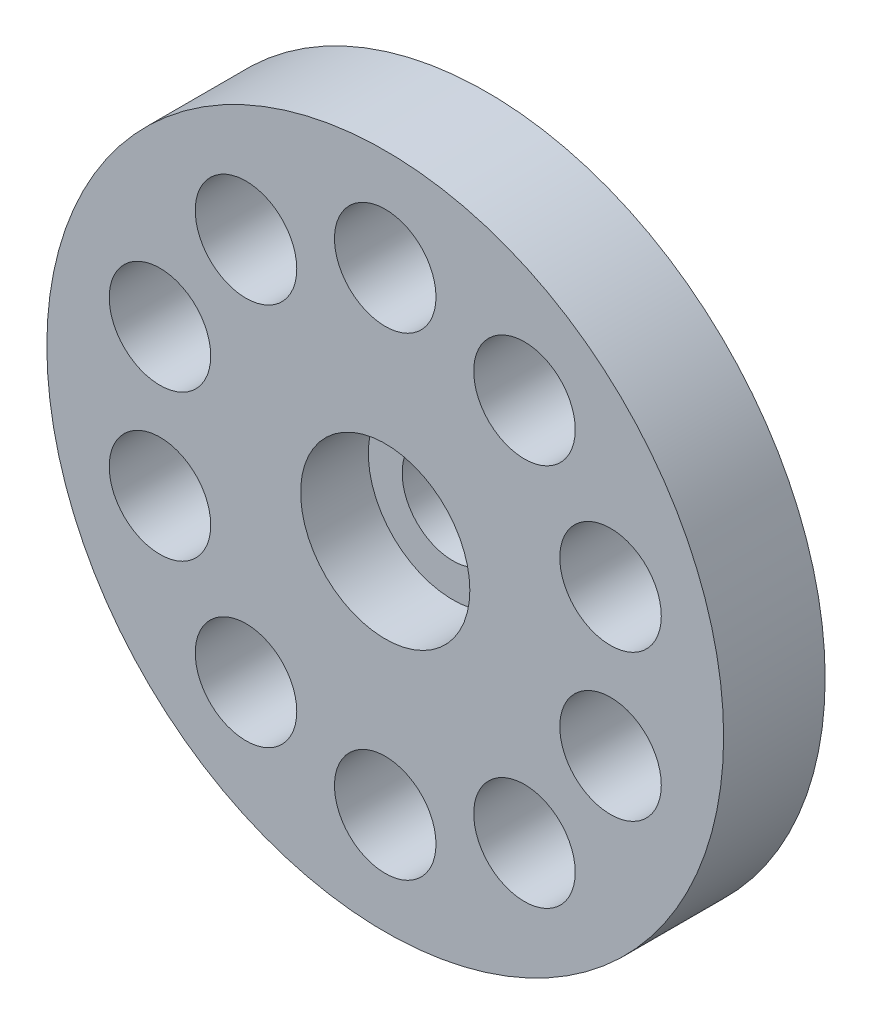
ISO-10303-21;
HEADER;
FILE_DESCRIPTION(('STEP AP214'),'2;1');
FILE_NAME('part.step','',(''),(''),'','','');
FILE_SCHEMA(('AUTOMOTIVE_DESIGN { 1 0 10303 214 1 1 1 1 }'));
ENDSEC;
DATA;
#1=APPLICATION_CONTEXT('core data for automotive mechanical design processes');
#2=APPLICATION_PROTOCOL_DEFINITION('international standard','automotive_design',2000,#1);
#3=PRODUCT_CONTEXT('',#1,'mechanical');
#4=PRODUCT('Part','Part','',(#3));
#5=PRODUCT_RELATED_PRODUCT_CATEGORY('part','',(#4));
#6=PRODUCT_DEFINITION_FORMATION('','',#4);
#7=PRODUCT_DEFINITION_CONTEXT('part definition',#1,'design');
#8=PRODUCT_DEFINITION('design','',#6,#7);
#9=PRODUCT_DEFINITION_SHAPE('','',#8);
#10=(LENGTH_UNIT() NAMED_UNIT(*) SI_UNIT(.MILLI.,.METRE.));
#11=(NAMED_UNIT(*) PLANE_ANGLE_UNIT() SI_UNIT($,.RADIAN.));
#12=(NAMED_UNIT(*) SI_UNIT($,.STERADIAN.) SOLID_ANGLE_UNIT());
#13=UNCERTAINTY_MEASURE_WITH_UNIT(LENGTH_MEASURE(1.E-05),#10,'distance_accuracy_value','');
#14=(GEOMETRIC_REPRESENTATION_CONTEXT(3) GLOBAL_UNCERTAINTY_ASSIGNED_CONTEXT((#13)) GLOBAL_UNIT_ASSIGNED_CONTEXT((#10,
#11,#12)) REPRESENTATION_CONTEXT('',''));
#15=CARTESIAN_POINT('',(0.,0.,0.));
#16=DIRECTION('',(0.,0.,1.));
#17=DIRECTION('',(1.,0.,0.));
#18=AXIS2_PLACEMENT_3D('',#15,#16,#17);
#19=CARTESIAN_POINT('',(0.,0.,3.));
#20=DIRECTION('',(0.,0.,-1.));
#21=DIRECTION('',(-1.,0.,0.));
#22=AXIS2_PLACEMENT_3D('',#19,#20,#21);
#23=CYLINDRICAL_SURFACE('',#22,1.5);
#24=CARTESIAN_POINT('',(0.,0.,0.));
#25=DIRECTION('',(0.,0.,1.));
#26=DIRECTION('',(1.,0.,0.));
#27=AXIS2_PLACEMENT_3D('',#24,#25,#26);
#28=CIRCLE('',#27,1.5);
#29=CARTESIAN_POINT('',(1.5,0.,0.));
#30=VERTEX_POINT('',#29);
#31=EDGE_CURVE('E52',#30,#30,#28,.T.);
#32=ORIENTED_EDGE('',*,*,#31,.F.);
#33=EDGE_LOOP('',(#32));
#34=FACE_BOUND('',#33,.T.);
#35=CARTESIAN_POINT('',(0.,0.,1.));
#36=DIRECTION('',(0.,0.,1.));
#37=DIRECTION('',(1.,0.,0.));
#38=AXIS2_PLACEMENT_3D('',#35,#36,#37);
#39=CIRCLE('',#38,1.5);
#40=CARTESIAN_POINT('',(1.5,0.,1.));
#41=VERTEX_POINT('',#40);
#42=EDGE_CURVE('E41',#41,#41,#39,.T.);
#43=ORIENTED_EDGE('',*,*,#42,.T.);
#44=EDGE_LOOP('',(#43));
#45=FACE_BOUND('',#44,.T.);
#46=ADVANCED_FACE('F37',(#34,#45),#23,.F.);
#47=CARTESIAN_POINT('',(0.,0.,3.));
#48=DIRECTION('',(0.,0.,-1.));
#49=DIRECTION('',(-1.,0.,0.));
#50=AXIS2_PLACEMENT_3D('',#47,#48,#49);
#51=CYLINDRICAL_SURFACE('',#50,9.99999999999999);
#52=CARTESIAN_POINT('',(0.,0.,3.));
#53=DIRECTION('',(0.,0.,1.));
#54=DIRECTION('',(1.,0.,0.));
#55=AXIS2_PLACEMENT_3D('',#52,#53,#54);
#56=CIRCLE('',#55,9.99999999999999);
#57=CARTESIAN_POINT('',(9.99999999999999,0.,3.));
#58=VERTEX_POINT('',#57);
#59=EDGE_CURVE('E10',#58,#58,#56,.T.);
#60=ORIENTED_EDGE('',*,*,#59,.F.);
#61=EDGE_LOOP('',(#60));
#62=FACE_BOUND('',#61,.T.);
#63=CARTESIAN_POINT('',(0.,0.,0.));
#64=DIRECTION('',(0.,0.,1.));
#65=DIRECTION('',(1.,0.,0.));
#66=AXIS2_PLACEMENT_3D('',#63,#64,#65);
#67=CIRCLE('',#66,9.99999999999999);
#68=CARTESIAN_POINT('',(9.99999999999999,0.,0.));
#69=VERTEX_POINT('',#68);
#70=EDGE_CURVE('E46',#69,#69,#67,.T.);
#71=ORIENTED_EDGE('',*,*,#70,.T.);
#72=EDGE_LOOP('',(#71));
#73=FACE_BOUND('',#72,.T.);
#74=ADVANCED_FACE('F39',(#62,#73),#51,.T.);
#75=CARTESIAN_POINT('',(0.,0.,3.));
#76=DIRECTION('',(0.,0.,1.));
#77=DIRECTION('',(1.,0.,0.));
#78=AXIS2_PLACEMENT_3D('',#75,#76,#77);
#79=PLANE('',#78);
#80=CARTESIAN_POINT('',(0.,0.,3.));
#81=DIRECTION('',(0.,0.,1.));
#82=DIRECTION('',(1.,0.,0.));
#83=AXIS2_PLACEMENT_3D('',#80,#81,#82);
#84=CIRCLE('',#83,2.5);
#85=CARTESIAN_POINT('',(2.5,0.,3.));
#86=VERTEX_POINT('',#85);
#87=EDGE_CURVE('E137',#86,#86,#84,.T.);
#88=ORIENTED_EDGE('',*,*,#87,.F.);
#89=EDGE_LOOP('',(#88));
#90=FACE_BOUND('',#89,.T.);
#91=CARTESIAN_POINT('',(0.,7.,3.));
#92=DIRECTION('',(0.,0.,1.));
#93=DIRECTION('',(1.,0.,0.));
#94=AXIS2_PLACEMENT_3D('',#91,#92,#93);
#95=CIRCLE('',#94,1.5);
#96=CARTESIAN_POINT('',(1.50000000000005,7.,3.));
#97=VERTEX_POINT('',#96);
#98=EDGE_CURVE('E98',#97,#97,#95,.T.);
#99=ORIENTED_EDGE('',*,*,#98,.F.);
#100=EDGE_LOOP('',(#99));
#101=FACE_BOUND('',#100,.T.);
#102=CARTESIAN_POINT('',(4.11449676604736,5.6631189606246,3.));
#103=DIRECTION('',(0.,0.,1.));
#104=DIRECTION('',(1.,0.,0.));
#105=AXIS2_PLACEMENT_3D('',#102,#103,#104);
#106=CIRCLE('',#105,1.5);
#107=CARTESIAN_POINT('',(5.61449676604736,5.6631189606246,3.));
#108=VERTEX_POINT('',#107);
#109=EDGE_CURVE('E107',#108,#108,#106,.T.);
#110=ORIENTED_EDGE('',*,*,#109,.F.);
#111=EDGE_LOOP('',(#110));
#112=FACE_BOUND('',#111,.T.);
#113=CARTESIAN_POINT('',(6.65739561406609,2.16311896062457,3.));
#114=DIRECTION('',(0.,0.,1.));
#115=DIRECTION('',(1.,0.,0.));
#116=AXIS2_PLACEMENT_3D('',#113,#114,#115);
#117=CIRCLE('',#116,1.5);
#118=CARTESIAN_POINT('',(8.15739561406609,2.16311896062457,3.));
#119=VERTEX_POINT('',#118);
#120=EDGE_CURVE('E115',#119,#119,#117,.T.);
#121=ORIENTED_EDGE('',*,*,#120,.F.);
#122=EDGE_LOOP('',(#121));
#123=FACE_BOUND('',#122,.T.);
#124=CARTESIAN_POINT('',(6.65739561406605,-2.16311896062471,3.));
#125=DIRECTION('',(0.,0.,1.));
#126=DIRECTION('',(1.,0.,0.));
#127=AXIS2_PLACEMENT_3D('',#124,#125,#126);
#128=CIRCLE('',#127,1.5);
#129=CARTESIAN_POINT('',(8.15739561406605,-2.16311896062471,3.));
#130=VERTEX_POINT('',#129);
#131=EDGE_CURVE('E123',#130,#130,#128,.T.);
#132=ORIENTED_EDGE('',*,*,#131,.F.);
#133=EDGE_LOOP('',(#132));
#134=FACE_BOUND('',#133,.T.);
#135=CARTESIAN_POINT('',(4.11449676604724,-5.66311896062468,3.));
#136=DIRECTION('',(0.,0.,1.));
#137=DIRECTION('',(1.,0.,0.));
#138=AXIS2_PLACEMENT_3D('',#135,#136,#137);
#139=CIRCLE('',#138,1.5);
#140=CARTESIAN_POINT('',(5.61449676604724,-5.66311896062468,3.));
#141=VERTEX_POINT('',#140);
#142=EDGE_CURVE('E66',#141,#141,#139,.T.);
#143=ORIENTED_EDGE('',*,*,#142,.F.);
#144=EDGE_LOOP('',(#143));
#145=FACE_BOUND('',#144,.T.);
#146=CARTESIAN_POINT('',(0.,-7.,3.));
#147=DIRECTION('',(0.,0.,1.));
#148=DIRECTION('',(1.,0.,0.));
#149=AXIS2_PLACEMENT_3D('',#146,#147,#148);
#150=CIRCLE('',#149,1.5);
#151=CARTESIAN_POINT('',(1.5,-7.,3.));
#152=VERTEX_POINT('',#151);
#153=EDGE_CURVE('E75',#152,#152,#150,.T.);
#154=ORIENTED_EDGE('',*,*,#153,.F.);
#155=EDGE_LOOP('',(#154));
#156=FACE_BOUND('',#155,.T.);
#157=CARTESIAN_POINT('',(-4.11449676604732,-5.66311896062463,3.));
#158=DIRECTION('',(0.,0.,1.));
#159=DIRECTION('',(1.,0.,0.));
#160=AXIS2_PLACEMENT_3D('',#157,#158,#159);
#161=CIRCLE('',#160,1.5);
#162=CARTESIAN_POINT('',(-2.61449676604732,-5.66311896062463,3.));
#163=VERTEX_POINT('',#162);
#164=EDGE_CURVE('E83',#163,#163,#161,.T.);
#165=ORIENTED_EDGE('',*,*,#164,.F.);
#166=EDGE_LOOP('',(#165));
#167=FACE_BOUND('',#166,.T.);
#168=CARTESIAN_POINT('',(-6.65739561406608,-2.16311896062461,3.));
#169=DIRECTION('',(0.,0.,1.));
#170=DIRECTION('',(1.,0.,0.));
#171=AXIS2_PLACEMENT_3D('',#168,#169,#170);
#172=CIRCLE('',#171,1.5);
#173=CARTESIAN_POINT('',(-5.15739561406608,-2.16311896062461,3.));
#174=VERTEX_POINT('',#173);
#175=EDGE_CURVE('E91',#174,#174,#172,.T.);
#176=ORIENTED_EDGE('',*,*,#175,.F.);
#177=EDGE_LOOP('',(#176));
#178=FACE_BOUND('',#177,.T.);
#179=CARTESIAN_POINT('',(-4.11449676604728,5.66311896062466,3.));
#180=DIRECTION('',(0.,0.,1.));
#181=DIRECTION('',(1.,0.,0.));
#182=AXIS2_PLACEMENT_3D('',#179,#180,#181);
#183=CIRCLE('',#182,1.5);
#184=CARTESIAN_POINT('',(-2.61449676604728,5.66311896062466,3.));
#185=VERTEX_POINT('',#184);
#186=EDGE_CURVE('E130',#185,#185,#183,.T.);
#187=ORIENTED_EDGE('',*,*,#186,.F.);
#188=EDGE_LOOP('',(#187));
#189=FACE_BOUND('',#188,.T.);
#190=CARTESIAN_POINT('',(-6.65739561406606,2.16311896062466,3.));
#191=DIRECTION('',(0.,0.,1.));
#192=DIRECTION('',(1.,0.,0.));
#193=AXIS2_PLACEMENT_3D('',#190,#191,#192);
#194=CIRCLE('',#193,1.5);
#195=CARTESIAN_POINT('',(-5.15739561406606,2.16311896062466,3.));
#196=VERTEX_POINT('',#195);
#197=EDGE_CURVE('E57',#196,#196,#194,.T.);
#198=ORIENTED_EDGE('',*,*,#197,.F.);
#199=EDGE_LOOP('',(#198));
#200=FACE_BOUND('',#199,.T.);
#201=ORIENTED_EDGE('',*,*,#59,.T.);
#202=EDGE_LOOP('',(#201));
#203=FACE_BOUND('',#202,.T.);
#204=ADVANCED_FACE('F167',(#90,#101,#112,#123,#134,#145,#156,#167,#178,#189,#200,#203),#79,.T.);
#205=CARTESIAN_POINT('',(0.,0.,0.));
#206=DIRECTION('',(0.,0.,1.));
#207=DIRECTION('',(1.,0.,0.));
#208=AXIS2_PLACEMENT_3D('',#205,#206,#207);
#209=PLANE('',#208);
#210=CARTESIAN_POINT('',(0.,7.,0.));
#211=DIRECTION('',(0.,0.,1.));
#212=DIRECTION('',(1.,0.,0.));
#213=AXIS2_PLACEMENT_3D('',#210,#211,#212);
#214=CIRCLE('',#213,1.5);
#215=CARTESIAN_POINT('',(1.50000000000005,7.,0.));
#216=VERTEX_POINT('',#215);
#217=EDGE_CURVE('E102',#216,#216,#214,.T.);
#218=ORIENTED_EDGE('',*,*,#217,.T.);
#219=EDGE_LOOP('',(#218));
#220=FACE_BOUND('',#219,.T.);
#221=CARTESIAN_POINT('',(4.11449676604736,5.6631189606246,0.));
#222=DIRECTION('',(0.,0.,1.));
#223=DIRECTION('',(1.,0.,0.));
#224=AXIS2_PLACEMENT_3D('',#221,#222,#223);
#225=CIRCLE('',#224,1.5);
#226=CARTESIAN_POINT('',(5.61449676604736,5.6631189606246,0.));
#227=VERTEX_POINT('',#226);
#228=EDGE_CURVE('E111',#227,#227,#225,.T.);
#229=ORIENTED_EDGE('',*,*,#228,.T.);
#230=EDGE_LOOP('',(#229));
#231=FACE_BOUND('',#230,.T.);
#232=CARTESIAN_POINT('',(6.65739561406609,2.16311896062457,0.));
#233=DIRECTION('',(0.,0.,1.));
#234=DIRECTION('',(1.,0.,0.));
#235=AXIS2_PLACEMENT_3D('',#232,#233,#234);
#236=CIRCLE('',#235,1.5);
#237=CARTESIAN_POINT('',(8.15739561406609,2.16311896062457,0.));
#238=VERTEX_POINT('',#237);
#239=EDGE_CURVE('E119',#238,#238,#236,.T.);
#240=ORIENTED_EDGE('',*,*,#239,.T.);
#241=EDGE_LOOP('',(#240));
#242=FACE_BOUND('',#241,.T.);
#243=CARTESIAN_POINT('',(6.65739561406605,-2.16311896062471,0.));
#244=DIRECTION('',(0.,0.,1.));
#245=DIRECTION('',(1.,0.,0.));
#246=AXIS2_PLACEMENT_3D('',#243,#244,#245);
#247=CIRCLE('',#246,1.5);
#248=CARTESIAN_POINT('',(8.15739561406605,-2.16311896062471,0.));
#249=VERTEX_POINT('',#248);
#250=EDGE_CURVE('E71',#249,#249,#247,.T.);
#251=ORIENTED_EDGE('',*,*,#250,.T.);
#252=EDGE_LOOP('',(#251));
#253=FACE_BOUND('',#252,.T.);
#254=CARTESIAN_POINT('',(4.11449676604724,-5.66311896062468,0.));
#255=DIRECTION('',(0.,0.,1.));
#256=DIRECTION('',(1.,0.,0.));
#257=AXIS2_PLACEMENT_3D('',#254,#255,#256);
#258=CIRCLE('',#257,1.5);
#259=CARTESIAN_POINT('',(5.61449676604724,-5.66311896062468,0.));
#260=VERTEX_POINT('',#259);
#261=EDGE_CURVE('E70',#260,#260,#258,.T.);
#262=ORIENTED_EDGE('',*,*,#261,.T.);
#263=EDGE_LOOP('',(#262));
#264=FACE_BOUND('',#263,.T.);
#265=CARTESIAN_POINT('',(0.,-7.,0.));
#266=DIRECTION('',(0.,0.,1.));
#267=DIRECTION('',(1.,0.,0.));
#268=AXIS2_PLACEMENT_3D('',#265,#266,#267);
#269=CIRCLE('',#268,1.5);
#270=CARTESIAN_POINT('',(1.5,-7.,0.));
#271=VERTEX_POINT('',#270);
#272=EDGE_CURVE('E79',#271,#271,#269,.T.);
#273=ORIENTED_EDGE('',*,*,#272,.T.);
#274=EDGE_LOOP('',(#273));
#275=FACE_BOUND('',#274,.T.);
#276=CARTESIAN_POINT('',(-4.11449676604732,-5.66311896062463,0.));
#277=DIRECTION('',(0.,0.,1.));
#278=DIRECTION('',(1.,0.,0.));
#279=AXIS2_PLACEMENT_3D('',#276,#277,#278);
#280=CIRCLE('',#279,1.5);
#281=CARTESIAN_POINT('',(-2.61449676604732,-5.66311896062463,0.));
#282=VERTEX_POINT('',#281);
#283=EDGE_CURVE('E87',#282,#282,#280,.T.);
#284=ORIENTED_EDGE('',*,*,#283,.T.);
#285=EDGE_LOOP('',(#284));
#286=FACE_BOUND('',#285,.T.);
#287=CARTESIAN_POINT('',(-6.65739561406608,-2.16311896062461,0.));
#288=DIRECTION('',(0.,0.,1.));
#289=DIRECTION('',(1.,0.,0.));
#290=AXIS2_PLACEMENT_3D('',#287,#288,#289);
#291=CIRCLE('',#290,1.5);
#292=CARTESIAN_POINT('',(-5.15739561406608,-2.16311896062461,0.));
#293=VERTEX_POINT('',#292);
#294=EDGE_CURVE('E62',#293,#293,#291,.T.);
#295=ORIENTED_EDGE('',*,*,#294,.T.);
#296=EDGE_LOOP('',(#295));
#297=FACE_BOUND('',#296,.T.);
#298=CARTESIAN_POINT('',(-4.11449676604728,5.66311896062466,0.));
#299=DIRECTION('',(0.,0.,1.));
#300=DIRECTION('',(1.,0.,0.));
#301=AXIS2_PLACEMENT_3D('',#298,#299,#300);
#302=CIRCLE('',#301,1.5);
#303=CARTESIAN_POINT('',(-2.61449676604728,5.66311896062466,0.));
#304=VERTEX_POINT('',#303);
#305=EDGE_CURVE('E103',#304,#304,#302,.T.);
#306=ORIENTED_EDGE('',*,*,#305,.T.);
#307=EDGE_LOOP('',(#306));
#308=FACE_BOUND('',#307,.T.);
#309=CARTESIAN_POINT('',(-6.65739561406606,2.16311896062466,0.));
#310=DIRECTION('',(0.,0.,1.));
#311=DIRECTION('',(1.,0.,0.));
#312=AXIS2_PLACEMENT_3D('',#309,#310,#311);
#313=CIRCLE('',#312,1.5);
#314=CARTESIAN_POINT('',(-5.15739561406606,2.16311896062466,0.));
#315=VERTEX_POINT('',#314);
#316=EDGE_CURVE('E58',#315,#315,#313,.T.);
#317=ORIENTED_EDGE('',*,*,#316,.T.);
#318=EDGE_LOOP('',(#317));
#319=FACE_BOUND('',#318,.T.);
#320=ORIENTED_EDGE('',*,*,#31,.T.);
#321=EDGE_LOOP('',(#320));
#322=FACE_BOUND('',#321,.T.);
#323=ORIENTED_EDGE('',*,*,#70,.F.);
#324=EDGE_LOOP('',(#323));
#325=FACE_BOUND('',#324,.T.);
#326=ADVANCED_FACE('F175',(#220,#231,#242,#253,#264,#275,#286,#297,#308,#319,#322,#325),#209,.F.);
#327=CARTESIAN_POINT('',(-6.65739561406606,2.16311896062466,3.));
#328=DIRECTION('',(0.,0.,-1.));
#329=DIRECTION('',(-1.,0.,0.));
#330=AXIS2_PLACEMENT_3D('',#327,#328,#329);
#331=CYLINDRICAL_SURFACE('',#330,1.5);
#332=ORIENTED_EDGE('',*,*,#197,.T.);
#333=EDGE_LOOP('',(#332));
#334=FACE_BOUND('',#333,.T.);
#335=ORIENTED_EDGE('',*,*,#316,.F.);
#336=EDGE_LOOP('',(#335));
#337=FACE_BOUND('',#336,.T.);
#338=ADVANCED_FACE('F172',(#334,#337),#331,.F.);
#339=CARTESIAN_POINT('',(-4.11449676604728,5.66311896062466,3.));
#340=DIRECTION('',(0.,0.,-1.));
#341=DIRECTION('',(-1.,0.,0.));
#342=AXIS2_PLACEMENT_3D('',#339,#340,#341);
#343=CYLINDRICAL_SURFACE('',#342,1.5);
#344=ORIENTED_EDGE('',*,*,#186,.T.);
#345=EDGE_LOOP('',(#344));
#346=FACE_BOUND('',#345,.T.);
#347=ORIENTED_EDGE('',*,*,#305,.F.);
#348=EDGE_LOOP('',(#347));
#349=FACE_BOUND('',#348,.T.);
#350=ADVANCED_FACE('F182',(#346,#349),#343,.F.);
#351=CARTESIAN_POINT('',(-6.65739561406608,-2.16311896062461,3.));
#352=DIRECTION('',(0.,0.,-1.));
#353=DIRECTION('',(-1.,0.,0.));
#354=AXIS2_PLACEMENT_3D('',#351,#352,#353);
#355=CYLINDRICAL_SURFACE('',#354,1.5);
#356=ORIENTED_EDGE('',*,*,#175,.T.);
#357=EDGE_LOOP('',(#356));
#358=FACE_BOUND('',#357,.T.);
#359=ORIENTED_EDGE('',*,*,#294,.F.);
#360=EDGE_LOOP('',(#359));
#361=FACE_BOUND('',#360,.T.);
#362=ADVANCED_FACE('F210',(#358,#361),#355,.F.);
#363=CARTESIAN_POINT('',(-4.11449676604732,-5.66311896062463,3.));
#364=DIRECTION('',(0.,0.,-1.));
#365=DIRECTION('',(-1.,0.,0.));
#366=AXIS2_PLACEMENT_3D('',#363,#364,#365);
#367=CYLINDRICAL_SURFACE('',#366,1.5);
#368=ORIENTED_EDGE('',*,*,#164,.T.);
#369=EDGE_LOOP('',(#368));
#370=FACE_BOUND('',#369,.T.);
#371=ORIENTED_EDGE('',*,*,#283,.F.);
#372=EDGE_LOOP('',(#371));
#373=FACE_BOUND('',#372,.T.);
#374=ADVANCED_FACE('F216',(#370,#373),#367,.F.);
#375=CARTESIAN_POINT('',(0.,-7.,3.));
#376=DIRECTION('',(0.,0.,-1.));
#377=DIRECTION('',(-1.,0.,0.));
#378=AXIS2_PLACEMENT_3D('',#375,#376,#377);
#379=CYLINDRICAL_SURFACE('',#378,1.5);
#380=ORIENTED_EDGE('',*,*,#153,.T.);
#381=EDGE_LOOP('',(#380));
#382=FACE_BOUND('',#381,.T.);
#383=ORIENTED_EDGE('',*,*,#272,.F.);
#384=EDGE_LOOP('',(#383));
#385=FACE_BOUND('',#384,.T.);
#386=ADVANCED_FACE('F238',(#382,#385),#379,.F.);
#387=CARTESIAN_POINT('',(4.11449676604724,-5.66311896062468,3.));
#388=DIRECTION('',(0.,0.,-1.));
#389=DIRECTION('',(-1.,0.,0.));
#390=AXIS2_PLACEMENT_3D('',#387,#388,#389);
#391=CYLINDRICAL_SURFACE('',#390,1.5);
#392=ORIENTED_EDGE('',*,*,#142,.T.);
#393=EDGE_LOOP('',(#392));
#394=FACE_BOUND('',#393,.T.);
#395=ORIENTED_EDGE('',*,*,#261,.F.);
#396=EDGE_LOOP('',(#395));
#397=FACE_BOUND('',#396,.T.);
#398=ADVANCED_FACE('F224',(#394,#397),#391,.F.);
#399=CARTESIAN_POINT('',(6.65739561406605,-2.16311896062471,3.));
#400=DIRECTION('',(0.,0.,-1.));
#401=DIRECTION('',(-1.,0.,0.));
#402=AXIS2_PLACEMENT_3D('',#399,#400,#401);
#403=CYLINDRICAL_SURFACE('',#402,1.5);
#404=ORIENTED_EDGE('',*,*,#131,.T.);
#405=EDGE_LOOP('',(#404));
#406=FACE_BOUND('',#405,.T.);
#407=ORIENTED_EDGE('',*,*,#250,.F.);
#408=EDGE_LOOP('',(#407));
#409=FACE_BOUND('',#408,.T.);
#410=ADVANCED_FACE('F220',(#406,#409),#403,.F.);
#411=CARTESIAN_POINT('',(6.65739561406609,2.16311896062457,3.));
#412=DIRECTION('',(0.,0.,-1.));
#413=DIRECTION('',(-1.,0.,0.));
#414=AXIS2_PLACEMENT_3D('',#411,#412,#413);
#415=CYLINDRICAL_SURFACE('',#414,1.5);
#416=ORIENTED_EDGE('',*,*,#120,.T.);
#417=EDGE_LOOP('',(#416));
#418=FACE_BOUND('',#417,.T.);
#419=ORIENTED_EDGE('',*,*,#239,.F.);
#420=EDGE_LOOP('',(#419));
#421=FACE_BOUND('',#420,.T.);
#422=ADVANCED_FACE('F223',(#418,#421),#415,.F.);
#423=CARTESIAN_POINT('',(4.11449676604736,5.6631189606246,3.));
#424=DIRECTION('',(0.,0.,-1.));
#425=DIRECTION('',(-1.,0.,0.));
#426=AXIS2_PLACEMENT_3D('',#423,#424,#425);
#427=CYLINDRICAL_SURFACE('',#426,1.5);
#428=ORIENTED_EDGE('',*,*,#109,.T.);
#429=EDGE_LOOP('',(#428));
#430=FACE_BOUND('',#429,.T.);
#431=ORIENTED_EDGE('',*,*,#228,.F.);
#432=EDGE_LOOP('',(#431));
#433=FACE_BOUND('',#432,.T.);
#434=ADVANCED_FACE('F228',(#430,#433),#427,.F.);
#435=CARTESIAN_POINT('',(0.,7.,3.));
#436=DIRECTION('',(0.,0.,-1.));
#437=DIRECTION('',(-1.,0.,0.));
#438=AXIS2_PLACEMENT_3D('',#435,#436,#437);
#439=CYLINDRICAL_SURFACE('',#438,1.5);
#440=ORIENTED_EDGE('',*,*,#98,.T.);
#441=EDGE_LOOP('',(#440));
#442=FACE_BOUND('',#441,.T.);
#443=ORIENTED_EDGE('',*,*,#217,.F.);
#444=EDGE_LOOP('',(#443));
#445=FACE_BOUND('',#444,.T.);
#446=ADVANCED_FACE('F158',(#442,#445),#439,.F.);
#447=CARTESIAN_POINT('',(0.,0.,1.));
#448=DIRECTION('',(0.,0.,1.));
#449=DIRECTION('',(1.,0.,0.));
#450=AXIS2_PLACEMENT_3D('',#447,#448,#449);
#451=CYLINDRICAL_SURFACE('',#450,2.5);
#452=CARTESIAN_POINT('',(0.,0.,1.));
#453=DIRECTION('',(0.,0.,1.));
#454=DIRECTION('',(1.,0.,0.));
#455=AXIS2_PLACEMENT_3D('',#452,#453,#454);
#456=CIRCLE('',#455,2.5);
#457=CARTESIAN_POINT('',(2.5,0.,1.));
#458=VERTEX_POINT('',#457);
#459=EDGE_CURVE('E141',#458,#458,#456,.T.);
#460=ORIENTED_EDGE('',*,*,#459,.F.);
#461=EDGE_LOOP('',(#460));
#462=FACE_BOUND('',#461,.T.);
#463=ORIENTED_EDGE('',*,*,#87,.T.);
#464=EDGE_LOOP('',(#463));
#465=FACE_BOUND('',#464,.T.);
#466=ADVANCED_FACE('F153',(#462,#465),#451,.F.);
#467=CARTESIAN_POINT('',(0.,0.,1.));
#468=DIRECTION('',(0.,0.,1.));
#469=DIRECTION('',(1.,0.,0.));
#470=AXIS2_PLACEMENT_3D('',#467,#468,#469);
#471=PLANE('',#470);
#472=ORIENTED_EDGE('',*,*,#42,.F.);
#473=EDGE_LOOP('',(#472));
#474=FACE_BOUND('',#473,.T.);
#475=ORIENTED_EDGE('',*,*,#459,.T.);
#476=EDGE_LOOP('',(#475));
#477=FACE_BOUND('',#476,.T.);
#478=ADVANCED_FACE('F151',(#474,#477),#471,.T.);
#479=CLOSED_SHELL('',(#46,#74,#204,#326,#338,#350,#362,#374,#386,#398,#410,#422,#434,#446,#466,#478));
#480=MANIFOLD_SOLID_BREP('B2',#479);
#481=ADVANCED_BREP_SHAPE_REPRESENTATION('',(#18,#480),#14);
#482=SHAPE_DEFINITION_REPRESENTATION(#9,#481);
ENDSEC;
END-ISO-10303-21;
